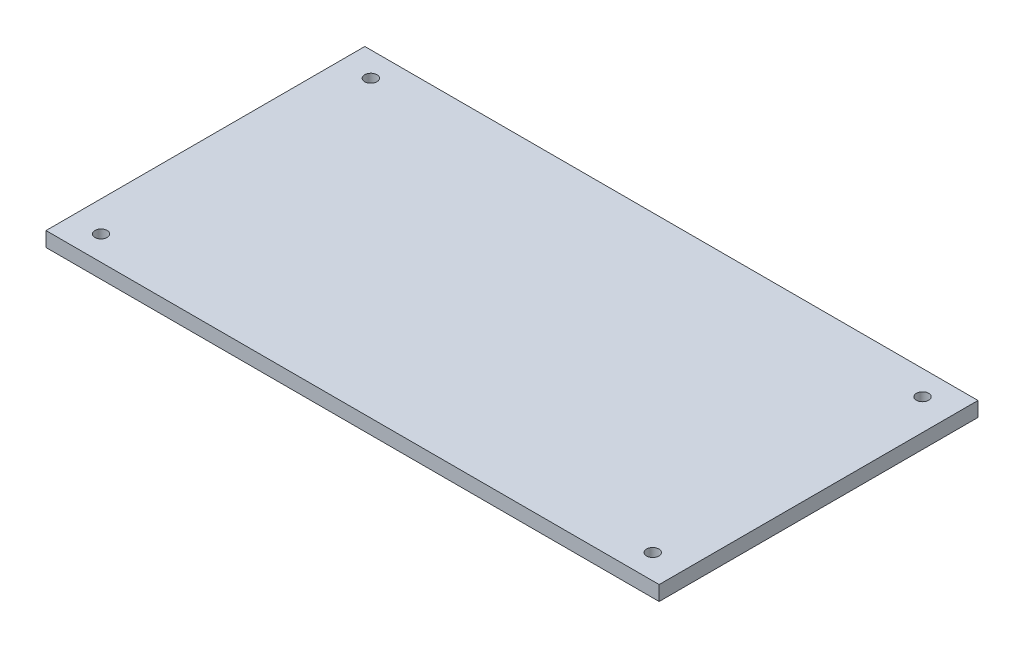
ISO-10303-21;
HEADER;
FILE_DESCRIPTION(('STEP AP214'),'2;1');
FILE_NAME('part.step','',(''),(''),'','','');
FILE_SCHEMA(('AUTOMOTIVE_DESIGN { 1 0 10303 214 1 1 1 1 }'));
ENDSEC;
DATA;
#1=APPLICATION_CONTEXT('core data for automotive mechanical design processes');
#2=APPLICATION_PROTOCOL_DEFINITION('international standard','automotive_design',2000,#1);
#3=PRODUCT_CONTEXT('',#1,'mechanical');
#4=PRODUCT('Part','Part','',(#3));
#5=PRODUCT_RELATED_PRODUCT_CATEGORY('part','',(#4));
#6=PRODUCT_DEFINITION_FORMATION('','',#4);
#7=PRODUCT_DEFINITION_CONTEXT('part definition',#1,'design');
#8=PRODUCT_DEFINITION('design','',#6,#7);
#9=PRODUCT_DEFINITION_SHAPE('','',#8);
#10=(LENGTH_UNIT() NAMED_UNIT(*) SI_UNIT(.MILLI.,.METRE.));
#11=(NAMED_UNIT(*) PLANE_ANGLE_UNIT() SI_UNIT($,.RADIAN.));
#12=(NAMED_UNIT(*) SI_UNIT($,.STERADIAN.) SOLID_ANGLE_UNIT());
#13=UNCERTAINTY_MEASURE_WITH_UNIT(LENGTH_MEASURE(1.E-05),#10,'distance_accuracy_value','');
#14=(GEOMETRIC_REPRESENTATION_CONTEXT(3) GLOBAL_UNCERTAINTY_ASSIGNED_CONTEXT((#13)) GLOBAL_UNIT_ASSIGNED_CONTEXT((#10,
#11,#12)) REPRESENTATION_CONTEXT('',''));
#15=CARTESIAN_POINT('',(0.,0.,0.));
#16=DIRECTION('',(0.,0.,1.));
#17=DIRECTION('',(1.,0.,0.));
#18=AXIS2_PLACEMENT_3D('',#15,#16,#17);
#19=CARTESIAN_POINT('',(-125.,6.,65.));
#20=DIRECTION('',(-1.,0.,0.));
#21=DIRECTION('',(0.,0.,1.));
#22=AXIS2_PLACEMENT_3D('',#19,#20,#21);
#23=PLANE('',#22);
#24=DIRECTION('',(0.,0.,-1.));
#25=VECTOR('',#24,1.);
#26=CARTESIAN_POINT('',(-125.,0.,65.));
#27=LINE('',#26,#25);
#28=CARTESIAN_POINT('',(-125.,0.,65.));
#29=VERTEX_POINT('',#28);
#30=CARTESIAN_POINT('',(-125.,0.,-65.));
#31=VERTEX_POINT('',#30);
#32=EDGE_CURVE('E100',#29,#31,#27,.T.);
#33=ORIENTED_EDGE('',*,*,#32,.F.);
#34=DIRECTION('',(0.,-1.,0.));
#35=VECTOR('',#34,1.);
#36=CARTESIAN_POINT('',(-125.,6.,65.));
#37=LINE('',#36,#35);
#38=CARTESIAN_POINT('',(-125.,6.,65.));
#39=VERTEX_POINT('',#38);
#40=EDGE_CURVE('E11',#39,#29,#37,.T.);
#41=ORIENTED_EDGE('',*,*,#40,.F.);
#42=DIRECTION('',(0.,0.,-1.));
#43=VECTOR('',#42,1.);
#44=CARTESIAN_POINT('',(-125.,6.,65.));
#45=LINE('',#44,#43);
#46=CARTESIAN_POINT('',(-125.,6.,-65.));
#47=VERTEX_POINT('',#46);
#48=EDGE_CURVE('E94',#39,#47,#45,.T.);
#49=ORIENTED_EDGE('',*,*,#48,.T.);
#50=DIRECTION('',(0.,-1.,0.));
#51=VECTOR('',#50,1.);
#52=CARTESIAN_POINT('',(-125.,6.,-65.));
#53=LINE('',#52,#51);
#54=EDGE_CURVE('E37',#47,#31,#53,.T.);
#55=ORIENTED_EDGE('',*,*,#54,.T.);
#56=EDGE_LOOP('',(#33,#41,#49,#55));
#57=FACE_BOUND('',#56,.T.);
#58=ADVANCED_FACE('F34',(#57),#23,.T.);
#59=CARTESIAN_POINT('',(-125.,6.,65.));
#60=DIRECTION('',(0.,0.,-1.));
#61=DIRECTION('',(-1.,0.,0.));
#62=AXIS2_PLACEMENT_3D('',#59,#60,#61);
#63=PLANE('',#62);
#64=DIRECTION('',(1.,0.,0.));
#65=VECTOR('',#64,1.);
#66=CARTESIAN_POINT('',(-125.,0.,65.));
#67=LINE('',#66,#65);
#68=CARTESIAN_POINT('',(125.,0.,65.));
#69=VERTEX_POINT('',#68);
#70=EDGE_CURVE('E67',#29,#69,#67,.T.);
#71=ORIENTED_EDGE('',*,*,#70,.T.);
#72=DIRECTION('',(0.,-1.,0.));
#73=VECTOR('',#72,1.);
#74=CARTESIAN_POINT('',(125.,6.,65.));
#75=LINE('',#74,#73);
#76=CARTESIAN_POINT('',(125.,6.,65.));
#77=VERTEX_POINT('',#76);
#78=EDGE_CURVE('E43',#77,#69,#75,.T.);
#79=ORIENTED_EDGE('',*,*,#78,.F.);
#80=DIRECTION('',(1.,0.,0.));
#81=VECTOR('',#80,1.);
#82=CARTESIAN_POINT('',(-125.,6.,65.));
#83=LINE('',#82,#81);
#84=EDGE_CURVE('E84',#39,#77,#83,.T.);
#85=ORIENTED_EDGE('',*,*,#84,.F.);
#86=ORIENTED_EDGE('',*,*,#40,.T.);
#87=EDGE_LOOP('',(#71,#79,#85,#86));
#88=FACE_BOUND('',#87,.T.);
#89=ADVANCED_FACE('F111',(#88),#63,.F.);
#90=CARTESIAN_POINT('',(125.,6.,65.));
#91=DIRECTION('',(-1.,0.,0.));
#92=DIRECTION('',(0.,0.,1.));
#93=AXIS2_PLACEMENT_3D('',#90,#91,#92);
#94=PLANE('',#93);
#95=DIRECTION('',(0.,0.,-1.));
#96=VECTOR('',#95,1.);
#97=CARTESIAN_POINT('',(125.,0.,65.));
#98=LINE('',#97,#96);
#99=CARTESIAN_POINT('',(125.,0.,-65.));
#100=VERTEX_POINT('',#99);
#101=EDGE_CURVE('E91',#69,#100,#98,.T.);
#102=ORIENTED_EDGE('',*,*,#101,.T.);
#103=DIRECTION('',(0.,-1.,0.));
#104=VECTOR('',#103,1.);
#105=CARTESIAN_POINT('',(125.,6.,-65.));
#106=LINE('',#105,#104);
#107=CARTESIAN_POINT('',(125.,6.,-65.));
#108=VERTEX_POINT('',#107);
#109=EDGE_CURVE('E88',#108,#100,#106,.T.);
#110=ORIENTED_EDGE('',*,*,#109,.F.);
#111=DIRECTION('',(0.,0.,-1.));
#112=VECTOR('',#111,1.);
#113=CARTESIAN_POINT('',(125.,6.,65.));
#114=LINE('',#113,#112);
#115=EDGE_CURVE('E79',#77,#108,#114,.T.);
#116=ORIENTED_EDGE('',*,*,#115,.F.);
#117=ORIENTED_EDGE('',*,*,#78,.T.);
#118=EDGE_LOOP('',(#102,#110,#116,#117));
#119=FACE_BOUND('',#118,.T.);
#120=ADVANCED_FACE('F89',(#119),#94,.F.);
#121=CARTESIAN_POINT('',(-125.,6.,-65.));
#122=DIRECTION('',(0.,0.,-1.));
#123=DIRECTION('',(-1.,0.,0.));
#124=AXIS2_PLACEMENT_3D('',#121,#122,#123);
#125=PLANE('',#124);
#126=DIRECTION('',(1.,0.,0.));
#127=VECTOR('',#126,1.);
#128=CARTESIAN_POINT('',(-125.,0.,-65.));
#129=LINE('',#128,#127);
#130=EDGE_CURVE('E103',#31,#100,#129,.T.);
#131=ORIENTED_EDGE('',*,*,#130,.F.);
#132=ORIENTED_EDGE('',*,*,#54,.F.);
#133=DIRECTION('',(1.,0.,0.));
#134=VECTOR('',#133,1.);
#135=CARTESIAN_POINT('',(-125.,6.,-65.));
#136=LINE('',#135,#134);
#137=EDGE_CURVE('E83',#47,#108,#136,.T.);
#138=ORIENTED_EDGE('',*,*,#137,.T.);
#139=ORIENTED_EDGE('',*,*,#109,.T.);
#140=EDGE_LOOP('',(#131,#132,#138,#139));
#141=FACE_BOUND('',#140,.T.);
#142=ADVANCED_FACE('F93',(#141),#125,.T.);
#143=CARTESIAN_POINT('',(0.,6.,0.));
#144=DIRECTION('',(0.,-1.,0.));
#145=DIRECTION('',(0.,0.,-1.));
#146=AXIS2_PLACEMENT_3D('',#143,#144,#145);
#147=PLANE('',#146);
#148=CARTESIAN_POINT('',(-112.56873616156,6.,55.));
#149=DIRECTION('',(0.,1.,0.));
#150=DIRECTION('',(0.,0.,1.));
#151=AXIS2_PLACEMENT_3D('',#148,#149,#150);
#152=CIRCLE('',#151,2.50000000000001);
#153=CARTESIAN_POINT('',(-112.56873616156,6.,57.5));
#154=VERTEX_POINT('',#153);
#155=EDGE_CURVE('E153',#154,#154,#152,.T.);
#156=ORIENTED_EDGE('',*,*,#155,.F.);
#157=EDGE_LOOP('',(#156));
#158=FACE_BOUND('',#157,.T.);
#159=CARTESIAN_POINT('',(-112.56873616156,6.,-55.));
#160=DIRECTION('',(0.,1.,0.));
#161=DIRECTION('',(0.,0.,1.));
#162=AXIS2_PLACEMENT_3D('',#159,#160,#161);
#163=CIRCLE('',#162,2.50000000000001);
#164=CARTESIAN_POINT('',(-112.56873616156,6.,-52.5));
#165=VERTEX_POINT('',#164);
#166=EDGE_CURVE('E157',#165,#165,#163,.T.);
#167=ORIENTED_EDGE('',*,*,#166,.F.);
#168=EDGE_LOOP('',(#167));
#169=FACE_BOUND('',#168,.T.);
#170=CARTESIAN_POINT('',(112.379080965068,6.,-55.));
#171=DIRECTION('',(0.,1.,0.));
#172=DIRECTION('',(0.,0.,1.));
#173=AXIS2_PLACEMENT_3D('',#170,#171,#172);
#174=CIRCLE('',#173,2.50000000000001);
#175=CARTESIAN_POINT('',(112.379080965068,6.,-52.5));
#176=VERTEX_POINT('',#175);
#177=EDGE_CURVE('E165',#176,#176,#174,.T.);
#178=ORIENTED_EDGE('',*,*,#177,.F.);
#179=EDGE_LOOP('',(#178));
#180=FACE_BOUND('',#179,.T.);
#181=CARTESIAN_POINT('',(112.379080965068,6.,55.));
#182=DIRECTION('',(0.,1.,0.));
#183=DIRECTION('',(0.,0.,1.));
#184=AXIS2_PLACEMENT_3D('',#181,#182,#183);
#185=CIRCLE('',#184,2.50000000000001);
#186=CARTESIAN_POINT('',(112.379080965068,6.,57.5));
#187=VERTEX_POINT('',#186);
#188=EDGE_CURVE('E104',#187,#187,#185,.T.);
#189=ORIENTED_EDGE('',*,*,#188,.F.);
#190=EDGE_LOOP('',(#189));
#191=FACE_BOUND('',#190,.T.);
#192=ORIENTED_EDGE('',*,*,#48,.F.);
#193=ORIENTED_EDGE('',*,*,#84,.T.);
#194=ORIENTED_EDGE('',*,*,#115,.T.);
#195=ORIENTED_EDGE('',*,*,#137,.F.);
#196=EDGE_LOOP('',(#192,#193,#194,#195));
#197=FACE_BOUND('',#196,.T.);
#198=ADVANCED_FACE('F82',(#158,#169,#180,#191,#197),#147,.F.);
#199=CARTESIAN_POINT('',(0.,0.,0.));
#200=DIRECTION('',(0.,-1.,0.));
#201=DIRECTION('',(0.,0.,-1.));
#202=AXIS2_PLACEMENT_3D('',#199,#200,#201);
#203=PLANE('',#202);
#204=CARTESIAN_POINT('',(-112.56873616156,0.,55.));
#205=DIRECTION('',(0.,1.,0.));
#206=DIRECTION('',(0.,0.,1.));
#207=AXIS2_PLACEMENT_3D('',#204,#205,#206);
#208=CIRCLE('',#207,2.50000000000001);
#209=CARTESIAN_POINT('',(-112.56873616156,0.,57.5));
#210=VERTEX_POINT('',#209);
#211=EDGE_CURVE('E156',#210,#210,#208,.T.);
#212=ORIENTED_EDGE('',*,*,#211,.T.);
#213=EDGE_LOOP('',(#212));
#214=FACE_BOUND('',#213,.T.);
#215=CARTESIAN_POINT('',(-112.56873616156,0.,-55.));
#216=DIRECTION('',(0.,1.,0.));
#217=DIRECTION('',(0.,0.,1.));
#218=AXIS2_PLACEMENT_3D('',#215,#216,#217);
#219=CIRCLE('',#218,2.50000000000001);
#220=CARTESIAN_POINT('',(-112.56873616156,0.,-52.5));
#221=VERTEX_POINT('',#220);
#222=EDGE_CURVE('E160',#221,#221,#219,.T.);
#223=ORIENTED_EDGE('',*,*,#222,.T.);
#224=EDGE_LOOP('',(#223));
#225=FACE_BOUND('',#224,.T.);
#226=CARTESIAN_POINT('',(112.379080965068,0.,-55.));
#227=DIRECTION('',(0.,1.,0.));
#228=DIRECTION('',(0.,0.,1.));
#229=AXIS2_PLACEMENT_3D('',#226,#227,#228);
#230=CIRCLE('',#229,2.50000000000001);
#231=CARTESIAN_POINT('',(112.379080965068,0.,-52.5));
#232=VERTEX_POINT('',#231);
#233=EDGE_CURVE('E167',#232,#232,#230,.T.);
#234=ORIENTED_EDGE('',*,*,#233,.T.);
#235=EDGE_LOOP('',(#234));
#236=FACE_BOUND('',#235,.T.);
#237=CARTESIAN_POINT('',(112.379080965068,0.,55.));
#238=DIRECTION('',(0.,1.,0.));
#239=DIRECTION('',(0.,0.,1.));
#240=AXIS2_PLACEMENT_3D('',#237,#238,#239);
#241=CIRCLE('',#240,2.50000000000001);
#242=CARTESIAN_POINT('',(112.379080965068,0.,57.5));
#243=VERTEX_POINT('',#242);
#244=EDGE_CURVE('E170',#243,#243,#241,.T.);
#245=ORIENTED_EDGE('',*,*,#244,.T.);
#246=EDGE_LOOP('',(#245));
#247=FACE_BOUND('',#246,.T.);
#248=ORIENTED_EDGE('',*,*,#32,.T.);
#249=ORIENTED_EDGE('',*,*,#130,.T.);
#250=ORIENTED_EDGE('',*,*,#101,.F.);
#251=ORIENTED_EDGE('',*,*,#70,.F.);
#252=EDGE_LOOP('',(#248,#249,#250,#251));
#253=FACE_BOUND('',#252,.T.);
#254=ADVANCED_FACE('F109',(#214,#225,#236,#247,#253),#203,.T.);
#255=CARTESIAN_POINT('',(112.379080965068,6.,55.));
#256=DIRECTION('',(0.,-1.,0.));
#257=DIRECTION('',(0.,0.,-1.));
#258=AXIS2_PLACEMENT_3D('',#255,#256,#257);
#259=CYLINDRICAL_SURFACE('',#258,2.50000000000001);
#260=ORIENTED_EDGE('',*,*,#188,.T.);
#261=EDGE_LOOP('',(#260));
#262=FACE_BOUND('',#261,.T.);
#263=ORIENTED_EDGE('',*,*,#244,.F.);
#264=EDGE_LOOP('',(#263));
#265=FACE_BOUND('',#264,.T.);
#266=ADVANCED_FACE('F130',(#262,#265),#259,.F.);
#267=CARTESIAN_POINT('',(112.379080965068,6.,-55.));
#268=DIRECTION('',(0.,-1.,0.));
#269=DIRECTION('',(0.,0.,-1.));
#270=AXIS2_PLACEMENT_3D('',#267,#268,#269);
#271=CYLINDRICAL_SURFACE('',#270,2.50000000000001);
#272=ORIENTED_EDGE('',*,*,#177,.T.);
#273=EDGE_LOOP('',(#272));
#274=FACE_BOUND('',#273,.T.);
#275=ORIENTED_EDGE('',*,*,#233,.F.);
#276=EDGE_LOOP('',(#275));
#277=FACE_BOUND('',#276,.T.);
#278=ADVANCED_FACE('F137',(#274,#277),#271,.F.);
#279=CARTESIAN_POINT('',(-112.56873616156,6.,-55.));
#280=DIRECTION('',(0.,-1.,0.));
#281=DIRECTION('',(0.,0.,-1.));
#282=AXIS2_PLACEMENT_3D('',#279,#280,#281);
#283=CYLINDRICAL_SURFACE('',#282,2.50000000000001);
#284=ORIENTED_EDGE('',*,*,#166,.T.);
#285=EDGE_LOOP('',(#284));
#286=FACE_BOUND('',#285,.T.);
#287=ORIENTED_EDGE('',*,*,#222,.F.);
#288=EDGE_LOOP('',(#287));
#289=FACE_BOUND('',#288,.T.);
#290=ADVANCED_FACE('F141',(#286,#289),#283,.F.);
#291=CARTESIAN_POINT('',(-112.56873616156,6.,55.));
#292=DIRECTION('',(0.,-1.,0.));
#293=DIRECTION('',(0.,0.,-1.));
#294=AXIS2_PLACEMENT_3D('',#291,#292,#293);
#295=CYLINDRICAL_SURFACE('',#294,2.50000000000001);
#296=ORIENTED_EDGE('',*,*,#155,.T.);
#297=EDGE_LOOP('',(#296));
#298=FACE_BOUND('',#297,.T.);
#299=ORIENTED_EDGE('',*,*,#211,.F.);
#300=EDGE_LOOP('',(#299));
#301=FACE_BOUND('',#300,.T.);
#302=ADVANCED_FACE('F145',(#298,#301),#295,.F.);
#303=CLOSED_SHELL('',(#58,#89,#120,#142,#198,#254,#266,#278,#290,#302));
#304=MANIFOLD_SOLID_BREP('B2',#303);
#305=ADVANCED_BREP_SHAPE_REPRESENTATION('',(#18,#304),#14);
#306=SHAPE_DEFINITION_REPRESENTATION(#9,#305);
ENDSEC;
END-ISO-10303-21;
